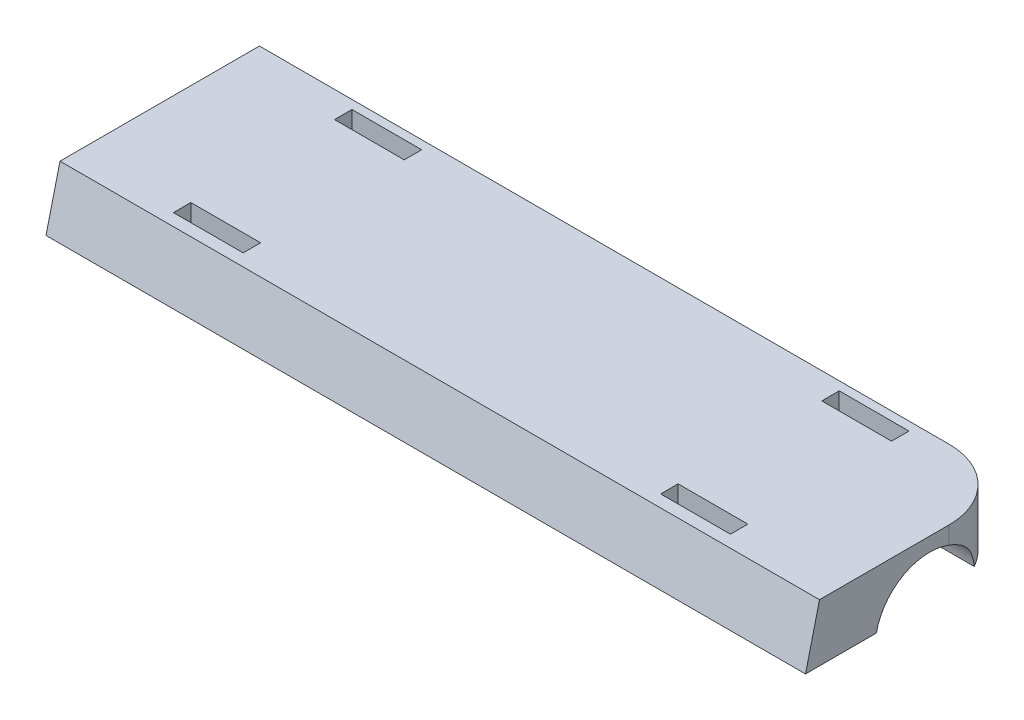
ISO-10303-21;
HEADER;
FILE_DESCRIPTION(('STEP AP214'),'2;1');
FILE_NAME('part.step','',(''),(''),'','','');
FILE_SCHEMA(('AUTOMOTIVE_DESIGN { 1 0 10303 214 1 1 1 1 }'));
ENDSEC;
DATA;
#1=APPLICATION_CONTEXT('core data for automotive mechanical design processes');
#2=APPLICATION_PROTOCOL_DEFINITION('international standard','automotive_design',2000,#1);
#3=PRODUCT_CONTEXT('',#1,'mechanical');
#4=PRODUCT('Part','Part','',(#3));
#5=PRODUCT_RELATED_PRODUCT_CATEGORY('part','',(#4));
#6=PRODUCT_DEFINITION_FORMATION('','',#4);
#7=PRODUCT_DEFINITION_CONTEXT('part definition',#1,'design');
#8=PRODUCT_DEFINITION('design','',#6,#7);
#9=PRODUCT_DEFINITION_SHAPE('','',#8);
#10=(LENGTH_UNIT() NAMED_UNIT(*) SI_UNIT(.MILLI.,.METRE.));
#11=(NAMED_UNIT(*) PLANE_ANGLE_UNIT() SI_UNIT($,.RADIAN.));
#12=(NAMED_UNIT(*) SI_UNIT($,.STERADIAN.) SOLID_ANGLE_UNIT());
#13=UNCERTAINTY_MEASURE_WITH_UNIT(LENGTH_MEASURE(1.E-05),#10,'distance_accuracy_value','');
#14=(GEOMETRIC_REPRESENTATION_CONTEXT(3) GLOBAL_UNCERTAINTY_ASSIGNED_CONTEXT((#13)) GLOBAL_UNIT_ASSIGNED_CONTEXT((#10,
#11,#12)) REPRESENTATION_CONTEXT('',''));
#15=CARTESIAN_POINT('',(0.,0.,0.));
#16=DIRECTION('',(0.,0.,1.));
#17=DIRECTION('',(1.,0.,0.));
#18=AXIS2_PLACEMENT_3D('',#15,#16,#17);
#19=CARTESIAN_POINT('',(10.5585542009237,24.606,0.));
#20=DIRECTION('',(0.,1.,0.));
#21=DIRECTION('',(0.,0.,1.));
#22=AXIS2_PLACEMENT_3D('',#19,#20,#21);
#23=PLANE('',#22);
#24=DIRECTION('',(-1.,0.,0.));
#25=VECTOR('',#24,1.);
#26=CARTESIAN_POINT('',(10.5585542009234,24.606,-116.3125));
#27=LINE('',#26,#25);
#28=CARTESIAN_POINT('',(170.664540126927,24.606,-116.3125));
#29=VERTEX_POINT('',#28);
#30=CARTESIAN_POINT('',(157.964540126927,24.606,-116.3125));
#31=VERTEX_POINT('',#30);
#32=EDGE_CURVE('E295',#29,#31,#27,.T.);
#33=ORIENTED_EDGE('',*,*,#32,.F.);
#34=DIRECTION('',(0.,0.,1.));
#35=VECTOR('',#34,1.);
#36=CARTESIAN_POINT('',(170.664540126928,24.606,-1.3996326925619E-12));
#37=LINE('',#36,#35);
#38=CARTESIAN_POINT('',(170.664540126927,24.606,-119.4875));
#39=VERTEX_POINT('',#38);
#40=EDGE_CURVE('E222',#39,#29,#37,.T.);
#41=ORIENTED_EDGE('',*,*,#40,.F.);
#42=DIRECTION('',(-1.,0.,0.));
#43=VECTOR('',#42,1.);
#44=CARTESIAN_POINT('',(10.5585542009234,24.606,-119.4875));
#45=LINE('',#44,#43);
#46=CARTESIAN_POINT('',(157.964540126927,24.606,-119.4875));
#47=VERTEX_POINT('',#46);
#48=EDGE_CURVE('E289',#39,#47,#45,.T.);
#49=ORIENTED_EDGE('',*,*,#48,.T.);
#50=DIRECTION('',(0.,0.,1.));
#51=VECTOR('',#50,1.);
#52=CARTESIAN_POINT('',(157.964540126927,24.606,0.));
#53=LINE('',#52,#51);
#54=EDGE_CURVE('E292',#47,#31,#53,.T.);
#55=ORIENTED_EDGE('',*,*,#54,.T.);
#56=EDGE_LOOP('',(#33,#41,#49,#55));
#57=FACE_BOUND('',#56,.T.);
#58=DIRECTION('',(1.,0.,0.));
#59=VECTOR('',#58,1.);
#60=CARTESIAN_POINT('',(10.5585542009237,24.606,-121.075));
#61=LINE('',#60,#59);
#62=CARTESIAN_POINT('',(50.8,24.606,-121.075));
#63=VERTEX_POINT('',#62);
#64=CARTESIAN_POINT('',(176.4,24.606,-121.075));
#65=VERTEX_POINT('',#64);
#66=EDGE_CURVE('E343',#63,#65,#61,.T.);
#67=ORIENTED_EDGE('',*,*,#66,.T.);
#68=CARTESIAN_POINT('',(176.4,24.606,-108.375));
#69=DIRECTION('',(0.,1.,0.));
#70=DIRECTION('',(0.,0.,1.));
#71=AXIS2_PLACEMENT_3D('',#68,#69,#70);
#72=CIRCLE('',#71,12.7);
#73=CARTESIAN_POINT('',(187.513805096758,24.606,-114.521001649144));
#74=VERTEX_POINT('',#73);
#75=EDGE_CURVE('E371',#65,#74,#72,.F.);
#76=ORIENTED_EDGE('',*,*,#75,.T.);
#77=DIRECTION('',(1.,0.,0.));
#78=VECTOR('',#77,1.);
#79=CARTESIAN_POINT('',(10.5585542009237,24.606,-114.521001649144));
#80=LINE('',#79,#78);
#81=CARTESIAN_POINT('',(50.8,24.606,-114.521001649144));
#82=VERTEX_POINT('',#81);
#83=EDGE_CURVE('E332',#82,#74,#80,.T.);
#84=ORIENTED_EDGE('',*,*,#83,.F.);
#85=DIRECTION('',(0.,0.,-1.));
#86=VECTOR('',#85,1.);
#87=CARTESIAN_POINT('',(50.8,24.606,0.));
#88=LINE('',#87,#86);
#89=EDGE_CURVE('E310',#82,#63,#88,.T.);
#90=ORIENTED_EDGE('',*,*,#89,.T.);
#91=EDGE_LOOP('',(#67,#76,#84,#90));
#92=FACE_BOUND('',#91,.T.);
#93=DIRECTION('',(0.,0.,1.));
#94=VECTOR('',#93,1.);
#95=CARTESIAN_POINT('',(81.9354598730726,24.606,0.));
#96=LINE('',#95,#94);
#97=CARTESIAN_POINT('',(81.9354598730726,24.606,-119.4875));
#98=VERTEX_POINT('',#97);
#99=CARTESIAN_POINT('',(81.9354598730726,24.606,-116.3125));
#100=VERTEX_POINT('',#99);
#101=EDGE_CURVE('E303',#98,#100,#96,.T.);
#102=ORIENTED_EDGE('',*,*,#101,.F.);
#103=DIRECTION('',(1.,0.,0.));
#104=VECTOR('',#103,1.);
#105=CARTESIAN_POINT('',(10.5585542009237,24.606,-119.4875));
#106=LINE('',#105,#104);
#107=CARTESIAN_POINT('',(69.2354598730726,24.606,-119.4875));
#108=VERTEX_POINT('',#107);
#109=EDGE_CURVE('E297',#108,#98,#106,.T.);
#110=ORIENTED_EDGE('',*,*,#109,.F.);
#111=DIRECTION('',(0.,0.,1.));
#112=VECTOR('',#111,1.);
#113=CARTESIAN_POINT('',(69.2354598730726,24.606,0.));
#114=LINE('',#113,#112);
#115=CARTESIAN_POINT('',(69.2354598730726,24.606,-116.3125));
#116=VERTEX_POINT('',#115);
#117=EDGE_CURVE('E198',#108,#116,#114,.T.);
#118=ORIENTED_EDGE('',*,*,#117,.T.);
#119=DIRECTION('',(1.,0.,0.));
#120=VECTOR('',#119,1.);
#121=CARTESIAN_POINT('',(10.5585542009237,24.606,-116.3125));
#122=LINE('',#121,#120);
#123=EDGE_CURVE('E300',#116,#100,#122,.T.);
#124=ORIENTED_EDGE('',*,*,#123,.T.);
#125=EDGE_LOOP('',(#102,#110,#118,#124));
#126=FACE_BOUND('',#125,.T.);
#127=ADVANCED_FACE('F34',(#57,#92,#126),#23,.F.);
#128=CARTESIAN_POINT('',(10.5585542009237,35.052,0.));
#129=DIRECTION('',(0.,-1.,0.));
#130=DIRECTION('',(0.,0.,-1.));
#131=AXIS2_PLACEMENT_3D('',#128,#129,#130);
#132=PLANE('',#131);
#133=DIRECTION('',(-1.,0.,0.));
#134=VECTOR('',#133,1.);
#135=CARTESIAN_POINT('',(-2.54198455810459E-13,35.052,-116.3125));
#136=LINE('',#135,#134);
#137=CARTESIAN_POINT('',(170.664540126927,35.052,-116.3125));
#138=VERTEX_POINT('',#137);
#139=CARTESIAN_POINT('',(157.964540126927,35.052,-116.3125));
#140=VERTEX_POINT('',#139);
#141=EDGE_CURVE('E225',#138,#140,#136,.T.);
#142=ORIENTED_EDGE('',*,*,#141,.T.);
#143=DIRECTION('',(0.,0.,1.));
#144=VECTOR('',#143,1.);
#145=CARTESIAN_POINT('',(157.964540126927,35.052,0.));
#146=LINE('',#145,#144);
#147=CARTESIAN_POINT('',(157.964540126927,35.052,-119.4875));
#148=VERTEX_POINT('',#147);
#149=EDGE_CURVE('E235',#148,#140,#146,.T.);
#150=ORIENTED_EDGE('',*,*,#149,.F.);
#151=DIRECTION('',(-1.,0.,0.));
#152=VECTOR('',#151,1.);
#153=CARTESIAN_POINT('',(-2.61137349714367E-13,35.052,-119.4875));
#154=LINE('',#153,#152);
#155=CARTESIAN_POINT('',(170.664540126927,35.052,-119.4875));
#156=VERTEX_POINT('',#155);
#157=EDGE_CURVE('E232',#156,#148,#154,.T.);
#158=ORIENTED_EDGE('',*,*,#157,.F.);
#159=DIRECTION('',(0.,0.,1.));
#160=VECTOR('',#159,1.);
#161=CARTESIAN_POINT('',(170.664540126928,35.052,-1.49193466091322E-12));
#162=LINE('',#161,#160);
#163=EDGE_CURVE('E228',#156,#138,#162,.T.);
#164=ORIENTED_EDGE('',*,*,#163,.T.);
#165=EDGE_LOOP('',(#142,#150,#158,#164));
#166=FACE_BOUND('',#165,.T.);
#167=DIRECTION('',(0.,0.,-1.));
#168=VECTOR('',#167,1.);
#169=CARTESIAN_POINT('',(69.2354598730726,35.052,0.));
#170=LINE('',#169,#168);
#171=CARTESIAN_POINT('',(69.2354598730726,35.052,-86.9755));
#172=VERTEX_POINT('',#171);
#173=CARTESIAN_POINT('',(69.2354598730726,35.052,-90.1505000000001));
#174=VERTEX_POINT('',#173);
#175=EDGE_CURVE('E268',#172,#174,#170,.T.);
#176=ORIENTED_EDGE('',*,*,#175,.T.);
#177=DIRECTION('',(1.,0.,0.));
#178=VECTOR('',#177,1.);
#179=CARTESIAN_POINT('',(0.,35.052,-90.1505000000001));
#180=LINE('',#179,#178);
#181=CARTESIAN_POINT('',(81.9354598730726,35.052,-90.1505000000001));
#182=VERTEX_POINT('',#181);
#183=EDGE_CURVE('E277',#174,#182,#180,.T.);
#184=ORIENTED_EDGE('',*,*,#183,.T.);
#185=DIRECTION('',(0.,0.,-1.));
#186=VECTOR('',#185,1.);
#187=CARTESIAN_POINT('',(81.9354598730726,35.052,0.));
#188=LINE('',#187,#186);
#189=CARTESIAN_POINT('',(81.9354598730726,35.052,-86.9755));
#190=VERTEX_POINT('',#189);
#191=EDGE_CURVE('E274',#190,#182,#188,.T.);
#192=ORIENTED_EDGE('',*,*,#191,.F.);
#193=DIRECTION('',(1.,0.,0.));
#194=VECTOR('',#193,1.);
#195=CARTESIAN_POINT('',(0.,35.052,-86.9755));
#196=LINE('',#195,#194);
#197=EDGE_CURVE('E271',#172,#190,#196,.T.);
#198=ORIENTED_EDGE('',*,*,#197,.F.);
#199=EDGE_LOOP('',(#176,#184,#192,#198));
#200=FACE_BOUND('',#199,.T.);
#201=DIRECTION('',(0.,0.,-1.));
#202=VECTOR('',#201,1.);
#203=CARTESIAN_POINT('',(189.1,35.052,0.));
#204=LINE('',#203,#202);
#205=CARTESIAN_POINT('',(189.1,35.052,-84.7575384615385));
#206=VERTEX_POINT('',#205);
#207=CARTESIAN_POINT('',(189.1,35.052,-108.375));
#208=VERTEX_POINT('',#207);
#209=EDGE_CURVE('E324',#206,#208,#204,.T.);
#210=ORIENTED_EDGE('',*,*,#209,.T.);
#211=CARTESIAN_POINT('',(176.4,35.052,-108.375));
#212=DIRECTION('',(0.,-1.,0.));
#213=DIRECTION('',(0.,0.,-1.));
#214=AXIS2_PLACEMENT_3D('',#211,#212,#213);
#215=CIRCLE('',#214,12.7);
#216=CARTESIAN_POINT('',(176.4,35.052,-121.075));
#217=VERTEX_POINT('',#216);
#218=EDGE_CURVE('E11',#208,#217,#215,.F.);
#219=ORIENTED_EDGE('',*,*,#218,.T.);
#220=DIRECTION('',(1.,0.,0.));
#221=VECTOR('',#220,1.);
#222=CARTESIAN_POINT('',(10.5585542009237,35.052,-121.075));
#223=LINE('',#222,#221);
#224=CARTESIAN_POINT('',(50.8,35.052,-121.075));
#225=VERTEX_POINT('',#224);
#226=EDGE_CURVE('E340',#225,#217,#223,.T.);
#227=ORIENTED_EDGE('',*,*,#226,.F.);
#228=DIRECTION('',(0.,0.,1.));
#229=VECTOR('',#228,1.);
#230=CARTESIAN_POINT('',(50.8,35.052,0.));
#231=LINE('',#230,#229);
#232=CARTESIAN_POINT('',(50.8,35.052,-84.7575384615385));
#233=VERTEX_POINT('',#232);
#234=EDGE_CURVE('E309',#225,#233,#231,.T.);
#235=ORIENTED_EDGE('',*,*,#234,.T.);
#236=DIRECTION('',(1.,0.,0.));
#237=VECTOR('',#236,1.);
#238=CARTESIAN_POINT('',(10.5585542009237,35.052,-84.7575384615385));
#239=LINE('',#238,#237);
#240=EDGE_CURVE('E338',#233,#206,#239,.T.);
#241=ORIENTED_EDGE('',*,*,#240,.T.);
#242=EDGE_LOOP('',(#210,#219,#227,#235,#241));
#243=FACE_BOUND('',#242,.T.);
#244=DIRECTION('',(-1.,0.,0.));
#245=VECTOR('',#244,1.);
#246=CARTESIAN_POINT('',(1.90083076138358E-13,35.052,-86.9755000000003));
#247=LINE('',#246,#245);
#248=CARTESIAN_POINT('',(170.664540126927,35.052,-86.9755));
#249=VERTEX_POINT('',#248);
#250=CARTESIAN_POINT('',(157.964540126927,35.052,-86.9755));
#251=VERTEX_POINT('',#250);
#252=EDGE_CURVE('E247',#249,#251,#247,.T.);
#253=ORIENTED_EDGE('',*,*,#252,.T.);
#254=DIRECTION('',(0.,0.,-1.));
#255=VECTOR('',#254,1.);
#256=CARTESIAN_POINT('',(157.964540126927,35.052,0.));
#257=LINE('',#256,#255);
#258=CARTESIAN_POINT('',(157.964540126927,35.052,-90.1505));
#259=VERTEX_POINT('',#258);
#260=EDGE_CURVE('E257',#251,#259,#257,.T.);
#261=ORIENTED_EDGE('',*,*,#260,.T.);
#262=DIRECTION('',(-1.,0.,0.));
#263=VECTOR('',#262,1.);
#264=CARTESIAN_POINT('',(1.97021970042265E-13,35.052,-90.1505000000003));
#265=LINE('',#264,#263);
#266=CARTESIAN_POINT('',(170.664540126927,35.052,-90.1505));
#267=VERTEX_POINT('',#266);
#268=EDGE_CURVE('E254',#267,#259,#265,.T.);
#269=ORIENTED_EDGE('',*,*,#268,.F.);
#270=DIRECTION('',(0.,0.,-1.));
#271=VECTOR('',#270,1.);
#272=CARTESIAN_POINT('',(170.664540126927,35.052,1.49193466091321E-12));
#273=LINE('',#272,#271);
#274=EDGE_CURVE('E250',#249,#267,#273,.T.);
#275=ORIENTED_EDGE('',*,*,#274,.F.);
#276=EDGE_LOOP('',(#253,#261,#269,#275));
#277=FACE_BOUND('',#276,.T.);
#278=DIRECTION('',(0.,0.,1.));
#279=VECTOR('',#278,1.);
#280=CARTESIAN_POINT('',(81.9354598730726,35.052,0.));
#281=LINE('',#280,#279);
#282=CARTESIAN_POINT('',(81.9354598730726,35.052,-119.4875));
#283=VERTEX_POINT('',#282);
#284=CARTESIAN_POINT('',(81.9354598730726,35.052,-116.3125));
#285=VERTEX_POINT('',#284);
#286=EDGE_CURVE('E211',#283,#285,#281,.T.);
#287=ORIENTED_EDGE('',*,*,#286,.T.);
#288=DIRECTION('',(1.,0.,0.));
#289=VECTOR('',#288,1.);
#290=CARTESIAN_POINT('',(0.,35.052,-116.3125));
#291=LINE('',#290,#289);
#292=CARTESIAN_POINT('',(69.2354598730726,35.052,-116.3125));
#293=VERTEX_POINT('',#292);
#294=EDGE_CURVE('E215',#293,#285,#291,.T.);
#295=ORIENTED_EDGE('',*,*,#294,.F.);
#296=DIRECTION('',(0.,0.,1.));
#297=VECTOR('',#296,1.);
#298=CARTESIAN_POINT('',(69.2354598730726,35.052,0.));
#299=LINE('',#298,#297);
#300=CARTESIAN_POINT('',(69.2354598730726,35.052,-119.4875));
#301=VERTEX_POINT('',#300);
#302=EDGE_CURVE('E195',#301,#293,#299,.T.);
#303=ORIENTED_EDGE('',*,*,#302,.F.);
#304=DIRECTION('',(1.,0.,0.));
#305=VECTOR('',#304,1.);
#306=CARTESIAN_POINT('',(0.,35.052,-119.4875));
#307=LINE('',#306,#305);
#308=EDGE_CURVE('E206',#301,#283,#307,.T.);
#309=ORIENTED_EDGE('',*,*,#308,.T.);
#310=EDGE_LOOP('',(#287,#295,#303,#309));
#311=FACE_BOUND('',#310,.T.);
#312=ADVANCED_FACE('F213',(#166,#200,#243,#277,#311),#132,.F.);
#313=CARTESIAN_POINT('',(10.5585542009237,24.606,0.));
#314=DIRECTION('',(0.,1.,0.));
#315=DIRECTION('',(0.,0.,1.));
#316=AXIS2_PLACEMENT_3D('',#313,#314,#315);
#317=PLANE('',#316);
#318=DIRECTION('',(0.,0.,-1.));
#319=VECTOR('',#318,1.);
#320=CARTESIAN_POINT('',(69.2354598730726,24.606,0.));
#321=LINE('',#320,#319);
#322=CARTESIAN_POINT('',(69.2354598730726,24.606,-86.9755));
#323=VERTEX_POINT('',#322);
#324=CARTESIAN_POINT('',(69.2354598730726,24.606,-90.1505000000001));
#325=VERTEX_POINT('',#324);
#326=EDGE_CURVE('E356',#323,#325,#321,.T.);
#327=ORIENTED_EDGE('',*,*,#326,.F.);
#328=DIRECTION('',(1.,0.,0.));
#329=VECTOR('',#328,1.);
#330=CARTESIAN_POINT('',(10.5585542009237,24.606,-86.9755));
#331=LINE('',#330,#329);
#332=CARTESIAN_POINT('',(81.9354598730726,24.606,-86.9755));
#333=VERTEX_POINT('',#332);
#334=EDGE_CURVE('E322',#323,#333,#331,.T.);
#335=ORIENTED_EDGE('',*,*,#334,.T.);
#336=DIRECTION('',(0.,0.,-1.));
#337=VECTOR('',#336,1.);
#338=CARTESIAN_POINT('',(81.9354598730726,24.606,0.));
#339=LINE('',#338,#337);
#340=CARTESIAN_POINT('',(81.9354598730726,24.606,-90.1505000000001));
#341=VERTEX_POINT('',#340);
#342=EDGE_CURVE('E351',#333,#341,#339,.T.);
#343=ORIENTED_EDGE('',*,*,#342,.T.);
#344=DIRECTION('',(1.,0.,0.));
#345=VECTOR('',#344,1.);
#346=CARTESIAN_POINT('',(10.5585542009237,24.606,-90.1505000000001));
#347=LINE('',#346,#345);
#348=EDGE_CURVE('E354',#325,#341,#347,.T.);
#349=ORIENTED_EDGE('',*,*,#348,.F.);
#350=EDGE_LOOP('',(#327,#335,#343,#349));
#351=FACE_BOUND('',#350,.T.);
#352=DIRECTION('',(1.,0.,0.));
#353=VECTOR('',#352,1.);
#354=CARTESIAN_POINT('',(10.5585542009237,24.606,-82.213));
#355=LINE('',#354,#353);
#356=CARTESIAN_POINT('',(50.8,24.606,-82.213));
#357=VERTEX_POINT('',#356);
#358=CARTESIAN_POINT('',(189.1,24.606,-82.213));
#359=VERTEX_POINT('',#358);
#360=EDGE_CURVE('E336',#357,#359,#355,.T.);
#361=ORIENTED_EDGE('',*,*,#360,.F.);
#362=DIRECTION('',(0.,0.,-1.));
#363=VECTOR('',#362,1.);
#364=CARTESIAN_POINT('',(50.8,24.606,0.));
#365=LINE('',#364,#363);
#366=CARTESIAN_POINT('',(50.8,24.606,-95.1169983508557));
#367=VERTEX_POINT('',#366);
#368=EDGE_CURVE('E316',#357,#367,#365,.T.);
#369=ORIENTED_EDGE('',*,*,#368,.T.);
#370=DIRECTION('',(1.,0.,0.));
#371=VECTOR('',#370,1.);
#372=CARTESIAN_POINT('',(10.5585542009237,24.606,-95.1169983508557));
#373=LINE('',#372,#371);
#374=CARTESIAN_POINT('',(189.1,24.606,-95.1169983508557));
#375=VERTEX_POINT('',#374);
#376=EDGE_CURVE('E333',#367,#375,#373,.T.);
#377=ORIENTED_EDGE('',*,*,#376,.T.);
#378=DIRECTION('',(0.,0.,1.));
#379=VECTOR('',#378,1.);
#380=CARTESIAN_POINT('',(189.1,24.606,0.));
#381=LINE('',#380,#379);
#382=EDGE_CURVE('E329',#375,#359,#381,.T.);
#383=ORIENTED_EDGE('',*,*,#382,.T.);
#384=EDGE_LOOP('',(#361,#369,#377,#383));
#385=FACE_BOUND('',#384,.T.);
#386=DIRECTION('',(-1.,0.,0.));
#387=VECTOR('',#386,1.);
#388=CARTESIAN_POINT('',(10.5585542009239,24.606,-86.9755000000003));
#389=LINE('',#388,#387);
#390=CARTESIAN_POINT('',(170.664540126927,24.606,-86.9755));
#391=VERTEX_POINT('',#390);
#392=CARTESIAN_POINT('',(157.964540126927,24.606,-86.9755));
#393=VERTEX_POINT('',#392);
#394=EDGE_CURVE('E366',#391,#393,#389,.T.);
#395=ORIENTED_EDGE('',*,*,#394,.F.);
#396=DIRECTION('',(0.,0.,-1.));
#397=VECTOR('',#396,1.);
#398=CARTESIAN_POINT('',(170.664540126927,24.606,1.39963269256188E-12));
#399=LINE('',#398,#397);
#400=CARTESIAN_POINT('',(170.664540126927,24.606,-90.1505));
#401=VERTEX_POINT('',#400);
#402=EDGE_CURVE('E358',#391,#401,#399,.T.);
#403=ORIENTED_EDGE('',*,*,#402,.T.);
#404=DIRECTION('',(-1.,0.,0.));
#405=VECTOR('',#404,1.);
#406=CARTESIAN_POINT('',(10.5585542009239,24.606,-90.1505000000003));
#407=LINE('',#406,#405);
#408=CARTESIAN_POINT('',(157.964540126927,24.606,-90.1505));
#409=VERTEX_POINT('',#408);
#410=EDGE_CURVE('E361',#401,#409,#407,.T.);
#411=ORIENTED_EDGE('',*,*,#410,.T.);
#412=DIRECTION('',(0.,0.,-1.));
#413=VECTOR('',#412,1.);
#414=CARTESIAN_POINT('',(157.964540126927,24.606,0.));
#415=LINE('',#414,#413);
#416=EDGE_CURVE('E364',#393,#409,#415,.T.);
#417=ORIENTED_EDGE('',*,*,#416,.F.);
#418=EDGE_LOOP('',(#395,#403,#411,#417));
#419=FACE_BOUND('',#418,.T.);
#420=ADVANCED_FACE('F393',(#351,#385,#419),#317,.F.);
#421=CARTESIAN_POINT('',(189.1,0.,0.));
#422=DIRECTION('',(1.,0.,0.));
#423=DIRECTION('',(0.,0.,-1.));
#424=AXIS2_PLACEMENT_3D('',#421,#422,#423);
#425=PLANE('',#424);
#426=CARTESIAN_POINT('',(189.1,22.606,-104.819));
#427=DIRECTION('',(1.,0.,0.));
#428=DIRECTION('',(0.,0.,-1.));
#429=AXIS2_PLACEMENT_3D('',#426,#427,#428);
#430=CIRCLE('',#429,9.906);
#431=CARTESIAN_POINT('',(189.1,31.8517395593863,-108.375));
#432=VERTEX_POINT('',#431);
#433=EDGE_CURVE('E305',#432,#375,#430,.T.);
#434=ORIENTED_EDGE('',*,*,#433,.F.);
#435=DIRECTION('',(0.,-1.,0.));
#436=VECTOR('',#435,1.);
#437=CARTESIAN_POINT('',(189.1,35.052,-108.375));
#438=LINE('',#437,#436);
#439=EDGE_CURVE('E43',#432,#208,#438,.F.);
#440=ORIENTED_EDGE('',*,*,#439,.T.);
#441=ORIENTED_EDGE('',*,*,#209,.F.);
#442=DIRECTION('',(0.,0.971590236301785,-0.236669416535052));
#443=VECTOR('',#442,1.);
#444=CARTESIAN_POINT('',(189.1,-17.5262839410397,-71.9500077579518));
#445=LINE('',#444,#443);
#446=EDGE_CURVE('E326',#359,#206,#445,.T.);
#447=ORIENTED_EDGE('',*,*,#446,.F.);
#448=ORIENTED_EDGE('',*,*,#382,.F.);
#449=EDGE_LOOP('',(#434,#440,#441,#447,#448));
#450=FACE_BOUND('',#449,.T.);
#451=ADVANCED_FACE('F389',(#450),#425,.T.);
#452=CARTESIAN_POINT('',(10.5585542009237,0.,-121.075));
#453=DIRECTION('',(0.,0.,1.));
#454=DIRECTION('',(1.,0.,0.));
#455=AXIS2_PLACEMENT_3D('',#452,#453,#454);
#456=PLANE('',#455);
#457=ORIENTED_EDGE('',*,*,#226,.T.);
#458=DIRECTION('',(0.,-1.,0.));
#459=VECTOR('',#458,1.);
#460=CARTESIAN_POINT('',(176.4,24.606,-121.075));
#461=LINE('',#460,#459);
#462=EDGE_CURVE('E368',#217,#65,#461,.T.);
#463=ORIENTED_EDGE('',*,*,#462,.T.);
#464=ORIENTED_EDGE('',*,*,#66,.F.);
#465=DIRECTION('',(0.,1.,0.));
#466=VECTOR('',#465,1.);
#467=CARTESIAN_POINT('',(50.8,0.,-121.075));
#468=LINE('',#467,#466);
#469=EDGE_CURVE('E306',#63,#225,#468,.T.);
#470=ORIENTED_EDGE('',*,*,#469,.T.);
#471=EDGE_LOOP('',(#457,#463,#464,#470));
#472=FACE_BOUND('',#471,.T.);
#473=ADVANCED_FACE('F386',(#472),#456,.F.);
#474=CARTESIAN_POINT('',(10.5585542009237,-17.5262839410397,-71.9500077579518));
#475=DIRECTION('',(0.,-0.236669416535052,-0.971590236301785));
#476=DIRECTION('',(0.,0.971590236301785,-0.236669416535052));
#477=AXIS2_PLACEMENT_3D('',#474,#475,#476);
#478=PLANE('',#477);
#479=ORIENTED_EDGE('',*,*,#240,.F.);
#480=DIRECTION('',(0.,-0.971590236301785,0.236669416535052));
#481=VECTOR('',#480,1.);
#482=CARTESIAN_POINT('',(50.8,-17.5262839410397,-71.9500077579518));
#483=LINE('',#482,#481);
#484=EDGE_CURVE('E313',#233,#357,#483,.T.);
#485=ORIENTED_EDGE('',*,*,#484,.T.);
#486=ORIENTED_EDGE('',*,*,#360,.T.);
#487=ORIENTED_EDGE('',*,*,#446,.T.);
#488=EDGE_LOOP('',(#479,#485,#486,#487));
#489=FACE_BOUND('',#488,.T.);
#490=ADVANCED_FACE('F382',(#489),#478,.F.);
#491=CARTESIAN_POINT('',(10.5585542009237,22.606,-104.819));
#492=DIRECTION('',(1.,0.,0.));
#493=DIRECTION('',(0.,0.,-1.));
#494=AXIS2_PLACEMENT_3D('',#491,#492,#493);
#495=CYLINDRICAL_SURFACE('',#494,9.906);
#496=ORIENTED_EDGE('',*,*,#83,.T.);
#497=CARTESIAN_POINT('',(187.513805096758,24.606,-114.521001649144));
#498=CARTESIAN_POINT('',(187.544962274607,24.8798963851684,-114.464565642875));
#499=CARTESIAN_POINT('',(187.582018582825,25.150636119133,-114.396640076956));
#500=CARTESIAN_POINT('',(187.665619497934,25.6838936654448,-114.238794042188));
#501=CARTESIAN_POINT('',(187.712156358062,25.9464179900145,-114.148891519271));
#502=CARTESIAN_POINT('',(187.812472984953,26.4618205317369,-113.947968010908));
#503=CARTESIAN_POINT('',(187.86625368144,26.7146975053278,-113.836944313871));
#504=CARTESIAN_POINT('',(187.978554498715,27.2095207874646,-113.594666798543));
#505=CARTESIAN_POINT('',(188.037075632273,27.4514647429342,-113.463408651824));
#506=CARTESIAN_POINT('',(188.156179096922,27.9226893004215,-113.181824207434));
#507=CARTESIAN_POINT('',(188.216756622456,28.1519965291626,-113.031540390586));
#508=CARTESIAN_POINT('',(188.337568108958,28.5974239446672,-112.71246075218));
#509=CARTESIAN_POINT('',(188.397802090737,28.8135449381042,-112.543666064804));
#510=CARTESIAN_POINT('',(188.515333842773,29.2311585751844,-112.188606516341));
#511=CARTESIAN_POINT('',(188.572636254534,29.4326745676789,-112.002370682176));
#512=CARTESIAN_POINT('',(188.681946591851,29.8202771140727,-111.613004603275));
#513=CARTESIAN_POINT('',(188.733954288345,30.0063630003636,-111.409873628306));
#514=CARTESIAN_POINT('',(188.829404585543,30.3587248028585,-110.991327263002));
#515=CARTESIAN_POINT('',(188.872978923894,30.5252860108946,-110.776182701595));
#516=CARTESIAN_POINT('',(188.950372948529,30.8408231027691,-110.331782544564));
#517=CARTESIAN_POINT('',(188.984195457339,30.9898040675651,-110.102531055344));
#518=CARTESIAN_POINT('',(189.040104712372,31.2697332106561,-109.629864365955));
#519=CARTESIAN_POINT('',(189.062117383581,31.4005638373392,-109.386370150959));
#520=CARTESIAN_POINT('',(189.084581469108,31.5814502332521,-109.012962328368));
#521=CARTESIAN_POINT('',(189.090310654817,31.6392214073603,-108.887039441341));
#522=CARTESIAN_POINT('',(189.098021220742,31.7494791836544,-108.632768703085));
#523=CARTESIAN_POINT('',(189.100002081971,31.8019650530951,-108.504420518538));
#524=CARTESIAN_POINT('',(189.1,31.8517395593863,-108.375));
#525=B_SPLINE_CURVE_WITH_KNOTS('',3,(#497,#498,#499,#500,#501,#502,#503,#504,#505,#506,#507,
#508,#509,#510,#511,#512,#513,#514,#515,#516,#517,#518,#519,#520,#521,#522,#523,#524),
.UNSPECIFIED.,.F.,.F.,(4,2,2,2,2,2,2,2,2,2,2,2,2,4),(0.,0.843665427966878,1.68664422401822,
2.52973131700043,3.37299900882378,4.21441599303507,5.05578145147259,5.89577071897165,
6.73579631101193,7.56139776091554,8.38676001198606,9.21724040192709,9.63307288877534,
10.0489629467648),.UNSPECIFIED.);
#526=EDGE_CURVE('E57',#74,#432,#525,.T.);
#527=ORIENTED_EDGE('',*,*,#526,.T.);
#528=ORIENTED_EDGE('',*,*,#433,.T.);
#529=ORIENTED_EDGE('',*,*,#376,.F.);
#530=CARTESIAN_POINT('',(50.8,22.606,-104.819));
#531=DIRECTION('',(1.,0.,0.));
#532=DIRECTION('',(0.,0.,-1.));
#533=AXIS2_PLACEMENT_3D('',#530,#531,#532);
#534=CIRCLE('',#533,9.906);
#535=EDGE_CURVE('E319',#367,#82,#534,.F.);
#536=ORIENTED_EDGE('',*,*,#535,.T.);
#537=EDGE_LOOP('',(#496,#527,#528,#529,#536));
#538=FACE_BOUND('',#537,.T.);
#539=ADVANCED_FACE('F377',(#538),#495,.F.);
#540=CARTESIAN_POINT('',(50.8,12.7,0.));
#541=DIRECTION('',(1.,0.,0.));
#542=DIRECTION('',(0.,0.,-1.));
#543=AXIS2_PLACEMENT_3D('',#540,#541,#542);
#544=PLANE('',#543);
#545=ORIENTED_EDGE('',*,*,#368,.F.);
#546=ORIENTED_EDGE('',*,*,#484,.F.);
#547=ORIENTED_EDGE('',*,*,#234,.F.);
#548=ORIENTED_EDGE('',*,*,#469,.F.);
#549=ORIENTED_EDGE('',*,*,#89,.F.);
#550=ORIENTED_EDGE('',*,*,#535,.F.);
#551=EDGE_LOOP('',(#545,#546,#547,#548,#549,#550));
#552=FACE_BOUND('',#551,.T.);
#553=ADVANCED_FACE('F381',(#552),#544,.F.);
#554=CARTESIAN_POINT('',(69.2354598730726,0.,0.));
#555=DIRECTION('',(1.,0.,0.));
#556=DIRECTION('',(0.,0.,-1.));
#557=AXIS2_PLACEMENT_3D('',#554,#555,#556);
#558=PLANE('',#557);
#559=ORIENTED_EDGE('',*,*,#326,.T.);
#560=DIRECTION('',(0.,1.,0.));
#561=VECTOR('',#560,1.);
#562=CARTESIAN_POINT('',(69.2354598730726,0.,-90.1505000000001));
#563=LINE('',#562,#561);
#564=EDGE_CURVE('E251',#325,#174,#563,.T.);
#565=ORIENTED_EDGE('',*,*,#564,.T.);
#566=ORIENTED_EDGE('',*,*,#175,.F.);
#567=DIRECTION('',(0.,1.,0.));
#568=VECTOR('',#567,1.);
#569=CARTESIAN_POINT('',(69.2354598730726,0.,-86.9755));
#570=LINE('',#569,#568);
#571=EDGE_CURVE('E280',#323,#172,#570,.T.);
#572=ORIENTED_EDGE('',*,*,#571,.F.);
#573=EDGE_LOOP('',(#559,#565,#566,#572));
#574=FACE_BOUND('',#573,.T.);
#575=ADVANCED_FACE('F405',(#574),#558,.T.);
#576=CARTESIAN_POINT('',(0.,0.,-90.1505000000001));
#577=DIRECTION('',(0.,0.,1.));
#578=DIRECTION('',(1.,0.,0.));
#579=AXIS2_PLACEMENT_3D('',#576,#577,#578);
#580=PLANE('',#579);
#581=ORIENTED_EDGE('',*,*,#348,.T.);
#582=DIRECTION('',(0.,1.,0.));
#583=VECTOR('',#582,1.);
#584=CARTESIAN_POINT('',(81.9354598730726,0.,-90.1505000000001));
#585=LINE('',#584,#583);
#586=EDGE_CURVE('E282',#341,#182,#585,.T.);
#587=ORIENTED_EDGE('',*,*,#586,.T.);
#588=ORIENTED_EDGE('',*,*,#183,.F.);
#589=ORIENTED_EDGE('',*,*,#564,.F.);
#590=EDGE_LOOP('',(#581,#587,#588,#589));
#591=FACE_BOUND('',#590,.T.);
#592=ADVANCED_FACE('F409',(#591),#580,.T.);
#593=CARTESIAN_POINT('',(81.9354598730726,0.,0.));
#594=DIRECTION('',(1.,0.,0.));
#595=DIRECTION('',(0.,0.,-1.));
#596=AXIS2_PLACEMENT_3D('',#593,#594,#595);
#597=PLANE('',#596);
#598=DIRECTION('',(0.,1.,0.));
#599=VECTOR('',#598,1.);
#600=CARTESIAN_POINT('',(81.9354598730726,0.,-86.9755));
#601=LINE('',#600,#599);
#602=EDGE_CURVE('E284',#333,#190,#601,.T.);
#603=ORIENTED_EDGE('',*,*,#602,.T.);
#604=ORIENTED_EDGE('',*,*,#191,.T.);
#605=ORIENTED_EDGE('',*,*,#586,.F.);
#606=ORIENTED_EDGE('',*,*,#342,.F.);
#607=EDGE_LOOP('',(#603,#604,#605,#606));
#608=FACE_BOUND('',#607,.T.);
#609=ADVANCED_FACE('F415',(#608),#597,.F.);
#610=CARTESIAN_POINT('',(0.,0.,-86.9755));
#611=DIRECTION('',(0.,0.,1.));
#612=DIRECTION('',(1.,0.,0.));
#613=AXIS2_PLACEMENT_3D('',#610,#611,#612);
#614=PLANE('',#613);
#615=ORIENTED_EDGE('',*,*,#571,.T.);
#616=ORIENTED_EDGE('',*,*,#197,.T.);
#617=ORIENTED_EDGE('',*,*,#602,.F.);
#618=ORIENTED_EDGE('',*,*,#334,.F.);
#619=EDGE_LOOP('',(#615,#616,#617,#618));
#620=FACE_BOUND('',#619,.T.);
#621=ADVANCED_FACE('F411',(#620),#614,.F.);
#622=CARTESIAN_POINT('',(1.90083076138358E-13,0.,-86.9755000000003));
#623=DIRECTION('',(0.,0.,-1.));
#624=DIRECTION('',(-1.,0.,0.));
#625=AXIS2_PLACEMENT_3D('',#622,#623,#624);
#626=PLANE('',#625);
#627=ORIENTED_EDGE('',*,*,#394,.T.);
#628=DIRECTION('',(0.,1.,0.));
#629=VECTOR('',#628,1.);
#630=CARTESIAN_POINT('',(157.964540126927,0.,-86.9755));
#631=LINE('',#630,#629);
#632=EDGE_CURVE('E229',#393,#251,#631,.T.);
#633=ORIENTED_EDGE('',*,*,#632,.T.);
#634=ORIENTED_EDGE('',*,*,#252,.F.);
#635=DIRECTION('',(0.,1.,0.));
#636=VECTOR('',#635,1.);
#637=CARTESIAN_POINT('',(170.664540126927,0.,-86.9755));
#638=LINE('',#637,#636);
#639=EDGE_CURVE('E260',#391,#249,#638,.T.);
#640=ORIENTED_EDGE('',*,*,#639,.F.);
#641=EDGE_LOOP('',(#627,#633,#634,#640));
#642=FACE_BOUND('',#641,.T.);
#643=ADVANCED_FACE('F414',(#642),#626,.T.);
#644=CARTESIAN_POINT('',(157.964540126927,0.,0.));
#645=DIRECTION('',(1.,0.,0.));
#646=DIRECTION('',(0.,0.,-1.));
#647=AXIS2_PLACEMENT_3D('',#644,#645,#646);
#648=PLANE('',#647);
#649=ORIENTED_EDGE('',*,*,#416,.T.);
#650=DIRECTION('',(0.,1.,0.));
#651=VECTOR('',#650,1.);
#652=CARTESIAN_POINT('',(157.964540126927,0.,-90.1505));
#653=LINE('',#652,#651);
#654=EDGE_CURVE('E262',#409,#259,#653,.T.);
#655=ORIENTED_EDGE('',*,*,#654,.T.);
#656=ORIENTED_EDGE('',*,*,#260,.F.);
#657=ORIENTED_EDGE('',*,*,#632,.F.);
#658=EDGE_LOOP('',(#649,#655,#656,#657));
#659=FACE_BOUND('',#658,.T.);
#660=ADVANCED_FACE('F425',(#659),#648,.T.);
#661=CARTESIAN_POINT('',(1.97021970042265E-13,0.,-90.1505000000003));
#662=DIRECTION('',(0.,0.,-1.));
#663=DIRECTION('',(-1.,0.,0.));
#664=AXIS2_PLACEMENT_3D('',#661,#662,#663);
#665=PLANE('',#664);
#666=DIRECTION('',(0.,1.,0.));
#667=VECTOR('',#666,1.);
#668=CARTESIAN_POINT('',(170.664540126927,0.,-90.1505));
#669=LINE('',#668,#667);
#670=EDGE_CURVE('E264',#401,#267,#669,.T.);
#671=ORIENTED_EDGE('',*,*,#670,.T.);
#672=ORIENTED_EDGE('',*,*,#268,.T.);
#673=ORIENTED_EDGE('',*,*,#654,.F.);
#674=ORIENTED_EDGE('',*,*,#410,.F.);
#675=EDGE_LOOP('',(#671,#672,#673,#674));
#676=FACE_BOUND('',#675,.T.);
#677=ADVANCED_FACE('F431',(#676),#665,.F.);
#678=CARTESIAN_POINT('',(170.664540126927,0.,1.49193466091321E-12));
#679=DIRECTION('',(1.,0.,0.));
#680=DIRECTION('',(0.,0.,-1.));
#681=AXIS2_PLACEMENT_3D('',#678,#679,#680);
#682=PLANE('',#681);
#683=ORIENTED_EDGE('',*,*,#639,.T.);
#684=ORIENTED_EDGE('',*,*,#274,.T.);
#685=ORIENTED_EDGE('',*,*,#670,.F.);
#686=ORIENTED_EDGE('',*,*,#402,.F.);
#687=EDGE_LOOP('',(#683,#684,#685,#686));
#688=FACE_BOUND('',#687,.T.);
#689=ADVANCED_FACE('F427',(#688),#682,.F.);
#690=CARTESIAN_POINT('',(-2.54198455810459E-13,0.,-116.3125));
#691=DIRECTION('',(0.,0.,-1.));
#692=DIRECTION('',(-1.,0.,0.));
#693=AXIS2_PLACEMENT_3D('',#690,#691,#692);
#694=PLANE('',#693);
#695=ORIENTED_EDGE('',*,*,#32,.T.);
#696=DIRECTION('',(0.,1.,0.));
#697=VECTOR('',#696,1.);
#698=CARTESIAN_POINT('',(157.964540126927,0.,-116.3125));
#699=LINE('',#698,#697);
#700=EDGE_CURVE('E239',#31,#140,#699,.T.);
#701=ORIENTED_EDGE('',*,*,#700,.T.);
#702=ORIENTED_EDGE('',*,*,#141,.F.);
#703=DIRECTION('',(0.,1.,0.));
#704=VECTOR('',#703,1.);
#705=CARTESIAN_POINT('',(170.664540126927,0.,-116.3125));
#706=LINE('',#705,#704);
#707=EDGE_CURVE('E238',#29,#138,#706,.T.);
#708=ORIENTED_EDGE('',*,*,#707,.F.);
#709=EDGE_LOOP('',(#695,#701,#702,#708));
#710=FACE_BOUND('',#709,.T.);
#711=ADVANCED_FACE('F430',(#710),#694,.T.);
#712=CARTESIAN_POINT('',(157.964540126927,0.,0.));
#713=DIRECTION('',(-1.,0.,0.));
#714=DIRECTION('',(0.,0.,1.));
#715=AXIS2_PLACEMENT_3D('',#712,#713,#714);
#716=PLANE('',#715);
#717=DIRECTION('',(0.,1.,0.));
#718=VECTOR('',#717,1.);
#719=CARTESIAN_POINT('',(157.964540126927,0.,-119.4875));
#720=LINE('',#719,#718);
#721=EDGE_CURVE('E241',#47,#148,#720,.T.);
#722=ORIENTED_EDGE('',*,*,#721,.T.);
#723=ORIENTED_EDGE('',*,*,#149,.T.);
#724=ORIENTED_EDGE('',*,*,#700,.F.);
#725=ORIENTED_EDGE('',*,*,#54,.F.);
#726=EDGE_LOOP('',(#722,#723,#724,#725));
#727=FACE_BOUND('',#726,.T.);
#728=ADVANCED_FACE('F441',(#727),#716,.F.);
#729=CARTESIAN_POINT('',(-2.61137349714367E-13,0.,-119.4875));
#730=DIRECTION('',(0.,0.,-1.));
#731=DIRECTION('',(-1.,0.,0.));
#732=AXIS2_PLACEMENT_3D('',#729,#730,#731);
#733=PLANE('',#732);
#734=DIRECTION('',(0.,1.,0.));
#735=VECTOR('',#734,1.);
#736=CARTESIAN_POINT('',(170.664540126927,0.,-119.4875));
#737=LINE('',#736,#735);
#738=EDGE_CURVE('E243',#39,#156,#737,.T.);
#739=ORIENTED_EDGE('',*,*,#738,.T.);
#740=ORIENTED_EDGE('',*,*,#157,.T.);
#741=ORIENTED_EDGE('',*,*,#721,.F.);
#742=ORIENTED_EDGE('',*,*,#48,.F.);
#743=EDGE_LOOP('',(#739,#740,#741,#742));
#744=FACE_BOUND('',#743,.T.);
#745=ADVANCED_FACE('F447',(#744),#733,.F.);
#746=CARTESIAN_POINT('',(170.664540126928,0.,-1.49193466091322E-12));
#747=DIRECTION('',(-1.,0.,0.));
#748=DIRECTION('',(0.,0.,1.));
#749=AXIS2_PLACEMENT_3D('',#746,#747,#748);
#750=PLANE('',#749);
#751=ORIENTED_EDGE('',*,*,#40,.T.);
#752=ORIENTED_EDGE('',*,*,#707,.T.);
#753=ORIENTED_EDGE('',*,*,#163,.F.);
#754=ORIENTED_EDGE('',*,*,#738,.F.);
#755=EDGE_LOOP('',(#751,#752,#753,#754));
#756=FACE_BOUND('',#755,.T.);
#757=ADVANCED_FACE('F443',(#756),#750,.T.);
#758=CARTESIAN_POINT('',(81.9354598730726,0.,0.));
#759=DIRECTION('',(-1.,0.,0.));
#760=DIRECTION('',(0.,0.,1.));
#761=AXIS2_PLACEMENT_3D('',#758,#759,#760);
#762=PLANE('',#761);
#763=ORIENTED_EDGE('',*,*,#101,.T.);
#764=DIRECTION('',(0.,1.,0.));
#765=VECTOR('',#764,1.);
#766=CARTESIAN_POINT('',(81.9354598730726,0.,-116.3125));
#767=LINE('',#766,#765);
#768=EDGE_CURVE('E220',#100,#285,#767,.T.);
#769=ORIENTED_EDGE('',*,*,#768,.T.);
#770=ORIENTED_EDGE('',*,*,#286,.F.);
#771=DIRECTION('',(0.,1.,0.));
#772=VECTOR('',#771,1.);
#773=CARTESIAN_POINT('',(81.9354598730726,0.,-119.4875));
#774=LINE('',#773,#772);
#775=EDGE_CURVE('E202',#98,#283,#774,.T.);
#776=ORIENTED_EDGE('',*,*,#775,.F.);
#777=EDGE_LOOP('',(#763,#769,#770,#776));
#778=FACE_BOUND('',#777,.T.);
#779=ADVANCED_FACE('F446',(#778),#762,.T.);
#780=CARTESIAN_POINT('',(0.,0.,-116.3125));
#781=DIRECTION('',(0.,0.,1.));
#782=DIRECTION('',(1.,0.,0.));
#783=AXIS2_PLACEMENT_3D('',#780,#781,#782);
#784=PLANE('',#783);
#785=DIRECTION('',(0.,1.,0.));
#786=VECTOR('',#785,1.);
#787=CARTESIAN_POINT('',(69.2354598730726,0.,-116.3125));
#788=LINE('',#787,#786);
#789=EDGE_CURVE('E201',#116,#293,#788,.T.);
#790=ORIENTED_EDGE('',*,*,#789,.T.);
#791=ORIENTED_EDGE('',*,*,#294,.T.);
#792=ORIENTED_EDGE('',*,*,#768,.F.);
#793=ORIENTED_EDGE('',*,*,#123,.F.);
#794=EDGE_LOOP('',(#790,#791,#792,#793));
#795=FACE_BOUND('',#794,.T.);
#796=ADVANCED_FACE('F457',(#795),#784,.F.);
#797=CARTESIAN_POINT('',(69.2354598730726,0.,0.));
#798=DIRECTION('',(-1.,0.,0.));
#799=DIRECTION('',(0.,0.,1.));
#800=AXIS2_PLACEMENT_3D('',#797,#798,#799);
#801=PLANE('',#800);
#802=DIRECTION('',(0.,1.,0.));
#803=VECTOR('',#802,1.);
#804=CARTESIAN_POINT('',(69.2354598730726,0.,-119.4875));
#805=LINE('',#804,#803);
#806=EDGE_CURVE('E190',#108,#301,#805,.T.);
#807=ORIENTED_EDGE('',*,*,#806,.T.);
#808=ORIENTED_EDGE('',*,*,#302,.T.);
#809=ORIENTED_EDGE('',*,*,#789,.F.);
#810=ORIENTED_EDGE('',*,*,#117,.F.);
#811=EDGE_LOOP('',(#807,#808,#809,#810));
#812=FACE_BOUND('',#811,.T.);
#813=ADVANCED_FACE('F192',(#812),#801,.F.);
#814=CARTESIAN_POINT('',(0.,0.,-119.4875));
#815=DIRECTION('',(0.,0.,1.));
#816=DIRECTION('',(1.,0.,0.));
#817=AXIS2_PLACEMENT_3D('',#814,#815,#816);
#818=PLANE('',#817);
#819=ORIENTED_EDGE('',*,*,#109,.T.);
#820=ORIENTED_EDGE('',*,*,#775,.T.);
#821=ORIENTED_EDGE('',*,*,#308,.F.);
#822=ORIENTED_EDGE('',*,*,#806,.F.);
#823=EDGE_LOOP('',(#819,#820,#821,#822));
#824=FACE_BOUND('',#823,.T.);
#825=ADVANCED_FACE('F207',(#824),#818,.T.);
#826=CARTESIAN_POINT('',(176.4,0.,-108.375));
#827=DIRECTION('',(0.,1.,0.));
#828=DIRECTION('',(0.,0.,1.));
#829=AXIS2_PLACEMENT_3D('',#826,#827,#828);
#830=CYLINDRICAL_SURFACE('',#829,12.7);
#831=ORIENTED_EDGE('',*,*,#218,.F.);
#832=ORIENTED_EDGE('',*,*,#439,.F.);
#833=ORIENTED_EDGE('',*,*,#526,.F.);
#834=ORIENTED_EDGE('',*,*,#75,.F.);
#835=ORIENTED_EDGE('',*,*,#462,.F.);
#836=EDGE_LOOP('',(#831,#832,#833,#834,#835));
#837=FACE_BOUND('',#836,.T.);
#838=ADVANCED_FACE('F36',(#837),#830,.T.);
#839=CLOSED_SHELL('',(#127,#312,#420,#451,#473,#490,#539,#553,#575,#592,#609,#621,#643,#660,
#677,#689,#711,#728,#745,#757,#779,#796,#813,#825,#838));
#840=MANIFOLD_SOLID_BREP('B2',#839);
#841=ADVANCED_BREP_SHAPE_REPRESENTATION('',(#18,#840),#14);
#842=SHAPE_DEFINITION_REPRESENTATION(#9,#841);
ENDSEC;
END-ISO-10303-21;
